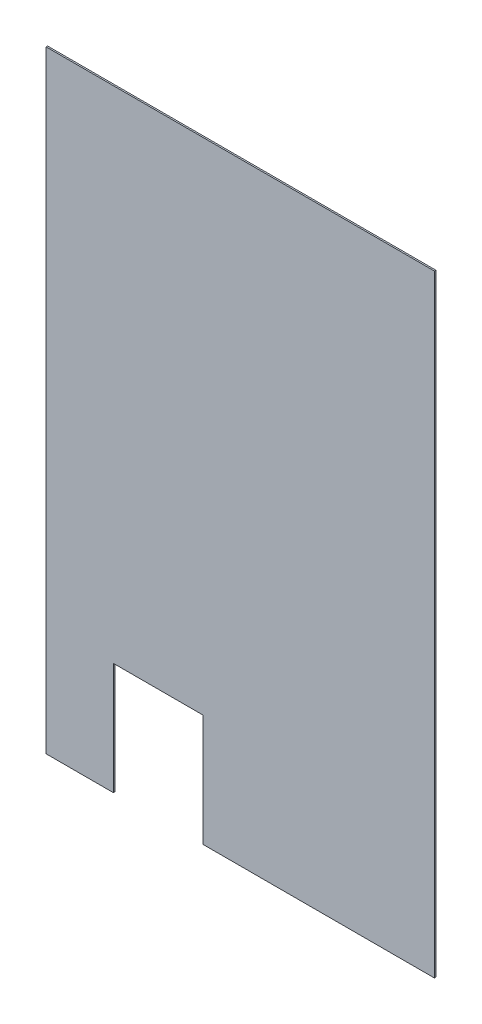
ISO-10303-21;
HEADER;
FILE_DESCRIPTION(('STEP AP214'),'2;1');
FILE_NAME('part.step','',(''),(''),'','','');
FILE_SCHEMA(('AUTOMOTIVE_DESIGN { 1 0 10303 214 1 1 1 1 }'));
ENDSEC;
DATA;
#1=APPLICATION_CONTEXT('core data for automotive mechanical design processes');
#2=APPLICATION_PROTOCOL_DEFINITION('international standard','automotive_design',2000,#1);
#3=PRODUCT_CONTEXT('',#1,'mechanical');
#4=PRODUCT('Part','Part','',(#3));
#5=PRODUCT_RELATED_PRODUCT_CATEGORY('part','',(#4));
#6=PRODUCT_DEFINITION_FORMATION('','',#4);
#7=PRODUCT_DEFINITION_CONTEXT('part definition',#1,'design');
#8=PRODUCT_DEFINITION('design','',#6,#7);
#9=PRODUCT_DEFINITION_SHAPE('','',#8);
#10=(LENGTH_UNIT() NAMED_UNIT(*) SI_UNIT(.MILLI.,.METRE.));
#11=(NAMED_UNIT(*) PLANE_ANGLE_UNIT() SI_UNIT($,.RADIAN.));
#12=(NAMED_UNIT(*) SI_UNIT($,.STERADIAN.) SOLID_ANGLE_UNIT());
#13=UNCERTAINTY_MEASURE_WITH_UNIT(LENGTH_MEASURE(1.E-05),#10,'distance_accuracy_value','');
#14=(GEOMETRIC_REPRESENTATION_CONTEXT(3) GLOBAL_UNCERTAINTY_ASSIGNED_CONTEXT((#13)) GLOBAL_UNIT_ASSIGNED_CONTEXT((#10,
#11,#12)) REPRESENTATION_CONTEXT('',''));
#15=CARTESIAN_POINT('',(0.,0.,0.));
#16=DIRECTION('',(0.,0.,1.));
#17=DIRECTION('',(1.,0.,0.));
#18=AXIS2_PLACEMENT_3D('',#15,#16,#17);
#19=CARTESIAN_POINT('',(0.,0.,2.54));
#20=DIRECTION('',(1.,0.,0.));
#21=DIRECTION('',(0.,0.,-1.));
#22=AXIS2_PLACEMENT_3D('',#19,#20,#21);
#23=PLANE('',#22);
#24=DIRECTION('',(0.,-1.,0.));
#25=VECTOR('',#24,1.);
#26=CARTESIAN_POINT('',(0.,0.,0.));
#27=LINE('',#26,#25);
#28=CARTESIAN_POINT('',(0.,1041.4,0.));
#29=VERTEX_POINT('',#28);
#30=CARTESIAN_POINT('',(0.,0.,0.));
#31=VERTEX_POINT('',#30);
#32=EDGE_CURVE('E129',#29,#31,#27,.T.);
#33=ORIENTED_EDGE('',*,*,#32,.T.);
#34=DIRECTION('',(0.,0.,-1.));
#35=VECTOR('',#34,1.);
#36=CARTESIAN_POINT('',(0.,0.,2.54));
#37=LINE('',#36,#35);
#38=CARTESIAN_POINT('',(0.,0.,2.54));
#39=VERTEX_POINT('',#38);
#40=EDGE_CURVE('E11',#39,#31,#37,.T.);
#41=ORIENTED_EDGE('',*,*,#40,.F.);
#42=DIRECTION('',(0.,-1.,0.));
#43=VECTOR('',#42,1.);
#44=CARTESIAN_POINT('',(0.,0.,2.54));
#45=LINE('',#44,#43);
#46=CARTESIAN_POINT('',(0.,1041.4,2.54));
#47=VERTEX_POINT('',#46);
#48=EDGE_CURVE('E143',#47,#39,#45,.T.);
#49=ORIENTED_EDGE('',*,*,#48,.F.);
#50=DIRECTION('',(0.,0.,-1.));
#51=VECTOR('',#50,1.);
#52=CARTESIAN_POINT('',(0.,1041.4,2.54));
#53=LINE('',#52,#51);
#54=EDGE_CURVE('E125',#47,#29,#53,.T.);
#55=ORIENTED_EDGE('',*,*,#54,.T.);
#56=EDGE_LOOP('',(#33,#41,#49,#55));
#57=FACE_BOUND('',#56,.T.);
#58=ADVANCED_FACE('F33',(#57),#23,.F.);
#59=CARTESIAN_POINT('',(0.,0.,2.54));
#60=DIRECTION('',(0.,1.,0.));
#61=DIRECTION('',(0.,0.,1.));
#62=AXIS2_PLACEMENT_3D('',#59,#60,#61);
#63=PLANE('',#62);
#64=DIRECTION('',(1.,0.,0.));
#65=VECTOR('',#64,1.);
#66=CARTESIAN_POINT('',(0.,0.,0.));
#67=LINE('',#66,#65);
#68=CARTESIAN_POINT('',(114.3,0.,0.));
#69=VERTEX_POINT('',#68);
#70=EDGE_CURVE('E132',#31,#69,#67,.T.);
#71=ORIENTED_EDGE('',*,*,#70,.T.);
#72=DIRECTION('',(0.,0.,-1.));
#73=VECTOR('',#72,1.);
#74=CARTESIAN_POINT('',(114.3,0.,2.54));
#75=LINE('',#74,#73);
#76=CARTESIAN_POINT('',(114.3,0.,2.54));
#77=VERTEX_POINT('',#76);
#78=EDGE_CURVE('E41',#77,#69,#75,.T.);
#79=ORIENTED_EDGE('',*,*,#78,.F.);
#80=DIRECTION('',(1.,0.,0.));
#81=VECTOR('',#80,1.);
#82=CARTESIAN_POINT('',(0.,0.,2.54));
#83=LINE('',#82,#81);
#84=EDGE_CURVE('E92',#39,#77,#83,.T.);
#85=ORIENTED_EDGE('',*,*,#84,.F.);
#86=ORIENTED_EDGE('',*,*,#40,.T.);
#87=EDGE_LOOP('',(#71,#79,#85,#86));
#88=FACE_BOUND('',#87,.T.);
#89=ADVANCED_FACE('F178',(#88),#63,.F.);
#90=CARTESIAN_POINT('',(114.3,0.,2.54));
#91=DIRECTION('',(-1.,0.,0.));
#92=DIRECTION('',(0.,0.,1.));
#93=AXIS2_PLACEMENT_3D('',#90,#91,#92);
#94=PLANE('',#93);
#95=DIRECTION('',(0.,1.,0.));
#96=VECTOR('',#95,1.);
#97=CARTESIAN_POINT('',(114.3,0.,0.));
#98=LINE('',#97,#96);
#99=CARTESIAN_POINT('',(114.3,190.5,0.));
#100=VERTEX_POINT('',#99);
#101=EDGE_CURVE('E134',#69,#100,#98,.T.);
#102=ORIENTED_EDGE('',*,*,#101,.T.);
#103=DIRECTION('',(0.,0.,-1.));
#104=VECTOR('',#103,1.);
#105=CARTESIAN_POINT('',(114.3,190.5,2.54));
#106=LINE('',#105,#104);
#107=CARTESIAN_POINT('',(114.3,190.5,2.54));
#108=VERTEX_POINT('',#107);
#109=EDGE_CURVE('E150',#108,#100,#106,.T.);
#110=ORIENTED_EDGE('',*,*,#109,.F.);
#111=DIRECTION('',(0.,1.,0.));
#112=VECTOR('',#111,1.);
#113=CARTESIAN_POINT('',(114.3,0.,2.54));
#114=LINE('',#113,#112);
#115=EDGE_CURVE('E158',#77,#108,#114,.T.);
#116=ORIENTED_EDGE('',*,*,#115,.F.);
#117=ORIENTED_EDGE('',*,*,#78,.T.);
#118=EDGE_LOOP('',(#102,#110,#116,#117));
#119=FACE_BOUND('',#118,.T.);
#120=ADVANCED_FACE('F156',(#119),#94,.F.);
#121=CARTESIAN_POINT('',(114.3,190.5,2.54));
#122=DIRECTION('',(0.,1.,0.));
#123=DIRECTION('',(0.,0.,1.));
#124=AXIS2_PLACEMENT_3D('',#121,#122,#123);
#125=PLANE('',#124);
#126=DIRECTION('',(1.,0.,0.));
#127=VECTOR('',#126,1.);
#128=CARTESIAN_POINT('',(114.3,190.5,0.));
#129=LINE('',#128,#127);
#130=CARTESIAN_POINT('',(266.7,190.5,0.));
#131=VERTEX_POINT('',#130);
#132=EDGE_CURVE('E136',#100,#131,#129,.T.);
#133=ORIENTED_EDGE('',*,*,#132,.T.);
#134=DIRECTION('',(0.,0.,-1.));
#135=VECTOR('',#134,1.);
#136=CARTESIAN_POINT('',(266.7,190.5,2.54));
#137=LINE('',#136,#135);
#138=CARTESIAN_POINT('',(266.7,190.5,2.54));
#139=VERTEX_POINT('',#138);
#140=EDGE_CURVE('E147',#139,#131,#137,.T.);
#141=ORIENTED_EDGE('',*,*,#140,.F.);
#142=DIRECTION('',(1.,0.,0.));
#143=VECTOR('',#142,1.);
#144=CARTESIAN_POINT('',(114.3,190.5,2.54));
#145=LINE('',#144,#143);
#146=EDGE_CURVE('E170',#108,#139,#145,.T.);
#147=ORIENTED_EDGE('',*,*,#146,.F.);
#148=ORIENTED_EDGE('',*,*,#109,.T.);
#149=EDGE_LOOP('',(#133,#141,#147,#148));
#150=FACE_BOUND('',#149,.T.);
#151=ADVANCED_FACE('F166',(#150),#125,.F.);
#152=CARTESIAN_POINT('',(266.7,0.,2.54));
#153=DIRECTION('',(1.,0.,0.));
#154=DIRECTION('',(0.,0.,-1.));
#155=AXIS2_PLACEMENT_3D('',#152,#153,#154);
#156=PLANE('',#155);
#157=DIRECTION('',(0.,-1.,0.));
#158=VECTOR('',#157,1.);
#159=CARTESIAN_POINT('',(266.7,0.,0.));
#160=LINE('',#159,#158);
#161=CARTESIAN_POINT('',(266.7,0.,0.));
#162=VERTEX_POINT('',#161);
#163=EDGE_CURVE('E138',#131,#162,#160,.T.);
#164=ORIENTED_EDGE('',*,*,#163,.T.);
#165=DIRECTION('',(0.,0.,-1.));
#166=VECTOR('',#165,1.);
#167=CARTESIAN_POINT('',(266.7,0.,2.54));
#168=LINE('',#167,#166);
#169=CARTESIAN_POINT('',(266.7,0.,2.54));
#170=VERTEX_POINT('',#169);
#171=EDGE_CURVE('E120',#170,#162,#168,.T.);
#172=ORIENTED_EDGE('',*,*,#171,.F.);
#173=DIRECTION('',(0.,-1.,0.));
#174=VECTOR('',#173,1.);
#175=CARTESIAN_POINT('',(266.7,0.,2.54));
#176=LINE('',#175,#174);
#177=EDGE_CURVE('E111',#139,#170,#176,.T.);
#178=ORIENTED_EDGE('',*,*,#177,.F.);
#179=ORIENTED_EDGE('',*,*,#140,.T.);
#180=EDGE_LOOP('',(#164,#172,#178,#179));
#181=FACE_BOUND('',#180,.T.);
#182=ADVANCED_FACE('F169',(#181),#156,.F.);
#183=CARTESIAN_POINT('',(266.7,0.,2.54));
#184=DIRECTION('',(0.,1.,0.));
#185=DIRECTION('',(0.,0.,1.));
#186=AXIS2_PLACEMENT_3D('',#183,#184,#185);
#187=PLANE('',#186);
#188=DIRECTION('',(1.,0.,0.));
#189=VECTOR('',#188,1.);
#190=CARTESIAN_POINT('',(266.7,0.,0.));
#191=LINE('',#190,#189);
#192=CARTESIAN_POINT('',(660.4,0.,0.));
#193=VERTEX_POINT('',#192);
#194=EDGE_CURVE('E119',#162,#193,#191,.T.);
#195=ORIENTED_EDGE('',*,*,#194,.T.);
#196=DIRECTION('',(0.,0.,-1.));
#197=VECTOR('',#196,1.);
#198=CARTESIAN_POINT('',(660.4,0.,2.54));
#199=LINE('',#198,#197);
#200=CARTESIAN_POINT('',(660.4,0.,2.54));
#201=VERTEX_POINT('',#200);
#202=EDGE_CURVE('E116',#201,#193,#199,.T.);
#203=ORIENTED_EDGE('',*,*,#202,.F.);
#204=DIRECTION('',(1.,0.,0.));
#205=VECTOR('',#204,1.);
#206=CARTESIAN_POINT('',(266.7,0.,2.54));
#207=LINE('',#206,#205);
#208=EDGE_CURVE('E105',#170,#201,#207,.T.);
#209=ORIENTED_EDGE('',*,*,#208,.F.);
#210=ORIENTED_EDGE('',*,*,#171,.T.);
#211=EDGE_LOOP('',(#195,#203,#209,#210));
#212=FACE_BOUND('',#211,.T.);
#213=ADVANCED_FACE('F117',(#212),#187,.F.);
#214=CARTESIAN_POINT('',(660.4,0.,2.54));
#215=DIRECTION('',(-1.,0.,0.));
#216=DIRECTION('',(0.,0.,1.));
#217=AXIS2_PLACEMENT_3D('',#214,#215,#216);
#218=PLANE('',#217);
#219=DIRECTION('',(0.,1.,0.));
#220=VECTOR('',#219,1.);
#221=CARTESIAN_POINT('',(660.4,0.,0.));
#222=LINE('',#221,#220);
#223=CARTESIAN_POINT('',(660.4,1041.4,0.));
#224=VERTEX_POINT('',#223);
#225=EDGE_CURVE('E78',#193,#224,#222,.T.);
#226=ORIENTED_EDGE('',*,*,#225,.T.);
#227=DIRECTION('',(0.,0.,-1.));
#228=VECTOR('',#227,1.);
#229=CARTESIAN_POINT('',(660.4,1041.4,2.54));
#230=LINE('',#229,#228);
#231=CARTESIAN_POINT('',(660.4,1041.4,2.54));
#232=VERTEX_POINT('',#231);
#233=EDGE_CURVE('E121',#232,#224,#230,.T.);
#234=ORIENTED_EDGE('',*,*,#233,.F.);
#235=DIRECTION('',(0.,1.,0.));
#236=VECTOR('',#235,1.);
#237=CARTESIAN_POINT('',(660.4,0.,2.54));
#238=LINE('',#237,#236);
#239=EDGE_CURVE('E109',#201,#232,#238,.T.);
#240=ORIENTED_EDGE('',*,*,#239,.F.);
#241=ORIENTED_EDGE('',*,*,#202,.T.);
#242=EDGE_LOOP('',(#226,#234,#240,#241));
#243=FACE_BOUND('',#242,.T.);
#244=ADVANCED_FACE('F123',(#243),#218,.F.);
#245=CARTESIAN_POINT('',(0.,1041.4,2.54));
#246=DIRECTION('',(0.,-1.,0.));
#247=DIRECTION('',(0.,0.,-1.));
#248=AXIS2_PLACEMENT_3D('',#245,#246,#247);
#249=PLANE('',#248);
#250=DIRECTION('',(-1.,0.,0.));
#251=VECTOR('',#250,1.);
#252=CARTESIAN_POINT('',(0.,1041.4,0.));
#253=LINE('',#252,#251);
#254=EDGE_CURVE('E84',#224,#29,#253,.T.);
#255=ORIENTED_EDGE('',*,*,#254,.T.);
#256=ORIENTED_EDGE('',*,*,#54,.F.);
#257=DIRECTION('',(-1.,0.,0.));
#258=VECTOR('',#257,1.);
#259=CARTESIAN_POINT('',(0.,1041.4,2.54));
#260=LINE('',#259,#258);
#261=EDGE_CURVE('E49',#232,#47,#260,.T.);
#262=ORIENTED_EDGE('',*,*,#261,.F.);
#263=ORIENTED_EDGE('',*,*,#233,.T.);
#264=EDGE_LOOP('',(#255,#256,#262,#263));
#265=FACE_BOUND('',#264,.T.);
#266=ADVANCED_FACE('F194',(#265),#249,.F.);
#267=CARTESIAN_POINT('',(0.,0.,2.54));
#268=DIRECTION('',(0.,0.,-1.));
#269=DIRECTION('',(-1.,0.,0.));
#270=AXIS2_PLACEMENT_3D('',#267,#268,#269);
#271=PLANE('',#270);
#272=ORIENTED_EDGE('',*,*,#48,.T.);
#273=ORIENTED_EDGE('',*,*,#84,.T.);
#274=ORIENTED_EDGE('',*,*,#115,.T.);
#275=ORIENTED_EDGE('',*,*,#146,.T.);
#276=ORIENTED_EDGE('',*,*,#177,.T.);
#277=ORIENTED_EDGE('',*,*,#208,.T.);
#278=ORIENTED_EDGE('',*,*,#239,.T.);
#279=ORIENTED_EDGE('',*,*,#261,.T.);
#280=EDGE_LOOP('',(#272,#273,#274,#275,#276,#277,#278,#279));
#281=FACE_BOUND('',#280,.T.);
#282=ADVANCED_FACE('F107',(#281),#271,.F.);
#283=CARTESIAN_POINT('',(0.,0.,0.));
#284=DIRECTION('',(0.,0.,-1.));
#285=DIRECTION('',(-1.,0.,0.));
#286=AXIS2_PLACEMENT_3D('',#283,#284,#285);
#287=PLANE('',#286);
#288=ORIENTED_EDGE('',*,*,#32,.F.);
#289=ORIENTED_EDGE('',*,*,#254,.F.);
#290=ORIENTED_EDGE('',*,*,#225,.F.);
#291=ORIENTED_EDGE('',*,*,#194,.F.);
#292=ORIENTED_EDGE('',*,*,#163,.F.);
#293=ORIENTED_EDGE('',*,*,#132,.F.);
#294=ORIENTED_EDGE('',*,*,#101,.F.);
#295=ORIENTED_EDGE('',*,*,#70,.F.);
#296=EDGE_LOOP('',(#288,#289,#290,#291,#292,#293,#294,#295));
#297=FACE_BOUND('',#296,.T.);
#298=ADVANCED_FACE('F162',(#297),#287,.T.);
#299=CLOSED_SHELL('',(#58,#89,#120,#151,#182,#213,#244,#266,#282,#298));
#300=MANIFOLD_SOLID_BREP('B2',#299);
#301=ADVANCED_BREP_SHAPE_REPRESENTATION('',(#18,#300),#14);
#302=SHAPE_DEFINITION_REPRESENTATION(#9,#301);
ENDSEC;
END-ISO-10303-21;
